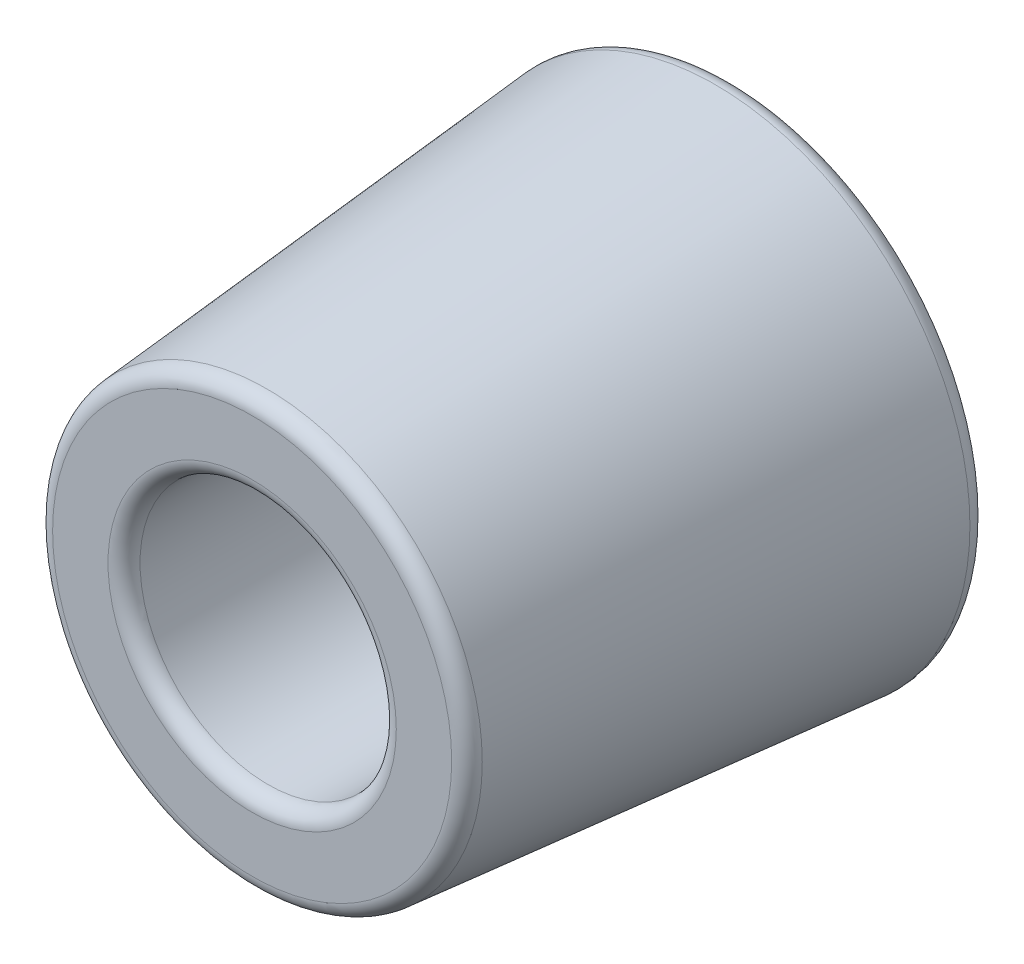
ISO-10303-21;
HEADER;
FILE_DESCRIPTION(('STEP AP214'),'2;1');
FILE_NAME('part.step','',(''),(''),'','','');
FILE_SCHEMA(('AUTOMOTIVE_DESIGN { 1 0 10303 214 1 1 1 1 }'));
ENDSEC;
DATA;
#1=APPLICATION_CONTEXT('core data for automotive mechanical design processes');
#2=APPLICATION_PROTOCOL_DEFINITION('international standard','automotive_design',2000,#1);
#3=PRODUCT_CONTEXT('',#1,'mechanical');
#4=PRODUCT('Part','Part','',(#3));
#5=PRODUCT_RELATED_PRODUCT_CATEGORY('part','',(#4));
#6=PRODUCT_DEFINITION_FORMATION('','',#4);
#7=PRODUCT_DEFINITION_CONTEXT('part definition',#1,'design');
#8=PRODUCT_DEFINITION('design','',#6,#7);
#9=PRODUCT_DEFINITION_SHAPE('','',#8);
#10=(LENGTH_UNIT() NAMED_UNIT(*) SI_UNIT(.MILLI.,.METRE.));
#11=(NAMED_UNIT(*) PLANE_ANGLE_UNIT() SI_UNIT($,.RADIAN.));
#12=(NAMED_UNIT(*) SI_UNIT($,.STERADIAN.) SOLID_ANGLE_UNIT());
#13=UNCERTAINTY_MEASURE_WITH_UNIT(LENGTH_MEASURE(1.E-05),#10,'distance_accuracy_value','');
#14=(GEOMETRIC_REPRESENTATION_CONTEXT(3) GLOBAL_UNCERTAINTY_ASSIGNED_CONTEXT((#13)) GLOBAL_UNIT_ASSIGNED_CONTEXT((#10,
#11,#12)) REPRESENTATION_CONTEXT('',''));
#15=CARTESIAN_POINT('',(0.,0.,0.));
#16=DIRECTION('',(0.,0.,1.));
#17=DIRECTION('',(1.,0.,0.));
#18=AXIS2_PLACEMENT_3D('',#15,#16,#17);
#19=CARTESIAN_POINT('',(0.,0.,-15.));
#20=DIRECTION('',(0.,0.,1.));
#21=DIRECTION('',(1.,0.,0.));
#22=AXIS2_PLACEMENT_3D('',#19,#20,#21);
#23=CYLINDRICAL_SURFACE('',#22,2.5);
#24=CARTESIAN_POINT('',(0.,0.,0.));
#25=DIRECTION('',(0.,0.,1.));
#26=DIRECTION('',(1.,0.,0.));
#27=AXIS2_PLACEMENT_3D('',#24,#25,#26);
#28=CIRCLE('',#27,2.5);
#29=CARTESIAN_POINT('',(2.5,0.,0.));
#30=VERTEX_POINT('',#29);
#31=EDGE_CURVE('E67',#30,#30,#28,.T.);
#32=ORIENTED_EDGE('',*,*,#31,.F.);
#33=EDGE_LOOP('',(#32));
#34=FACE_BOUND('',#33,.T.);
#35=CARTESIAN_POINT('',(0.,0.,5.));
#36=DIRECTION('',(0.,0.,1.));
#37=DIRECTION('',(1.,0.,0.));
#38=AXIS2_PLACEMENT_3D('',#35,#36,#37);
#39=CIRCLE('',#38,2.5);
#40=CARTESIAN_POINT('',(2.5,0.,5.));
#41=VERTEX_POINT('',#40);
#42=EDGE_CURVE('E68',#41,#41,#39,.F.);
#43=ORIENTED_EDGE('',*,*,#42,.F.);
#44=EDGE_LOOP('',(#43));
#45=FACE_BOUND('',#44,.T.);
#46=ADVANCED_FACE('F35',(#34,#45),#23,.F.);
#47=CARTESIAN_POINT('',(0.,0.,0.));
#48=DIRECTION('',(0.,0.,-1.));
#49=DIRECTION('',(1.,0.,0.));
#50=AXIS2_PLACEMENT_3D('',#47,#48,#49);
#51=CONICAL_SURFACE('',#50,8.,0.0872664625997167);
#52=CARTESIAN_POINT('',(0.,0.,14.5435778713738));
#53=DIRECTION('',(0.,0.,-1.));
#54=DIRECTION('',(-1.,0.,0.));
#55=AXIS2_PLACEMENT_3D('',#52,#53,#54);
#56=CIRCLE('',#55,6.7276018091483);
#57=CARTESIAN_POINT('',(-6.7276018091483,0.,14.5435778713738));
#58=VERTEX_POINT('',#57);
#59=EDGE_CURVE('E10',#58,#58,#56,.T.);
#60=ORIENTED_EDGE('',*,*,#59,.T.);
#61=EDGE_LOOP('',(#60));
#62=FACE_BOUND('',#61,.T.);
#63=CARTESIAN_POINT('',(0.,0.,0.543577871373824));
#64=DIRECTION('',(0.,0.,1.));
#65=DIRECTION('',(1.,0.,0.));
#66=AXIS2_PLACEMENT_3D('',#63,#64,#65);
#67=CIRCLE('',#66,7.95244309851124);
#68=CARTESIAN_POINT('',(7.95244309851124,0.,0.543577871373824));
#69=VERTEX_POINT('',#68);
#70=EDGE_CURVE('E54',#69,#69,#67,.T.);
#71=ORIENTED_EDGE('',*,*,#70,.T.);
#72=EDGE_LOOP('',(#71));
#73=FACE_BOUND('',#72,.T.);
#74=ADVANCED_FACE('F99',(#62,#73),#51,.T.);
#75=CARTESIAN_POINT('',(0.,0.,15.));
#76=DIRECTION('',(0.,0.,1.));
#77=DIRECTION('',(1.,0.,0.));
#78=AXIS2_PLACEMENT_3D('',#75,#76,#77);
#79=PLANE('',#78);
#80=CARTESIAN_POINT('',(0.,0.,15.));
#81=DIRECTION('',(0.,0.,1.));
#82=DIRECTION('',(1.,0.,0.));
#83=AXIS2_PLACEMENT_3D('',#80,#81,#82);
#84=CIRCLE('',#83,6.22950446010243);
#85=CARTESIAN_POINT('',(6.22950446010243,0.,15.));
#86=VERTEX_POINT('',#85);
#87=EDGE_CURVE('E43',#86,#86,#84,.T.);
#88=ORIENTED_EDGE('',*,*,#87,.T.);
#89=EDGE_LOOP('',(#88));
#90=FACE_BOUND('',#89,.T.);
#91=CARTESIAN_POINT('',(0.,0.,15.));
#92=DIRECTION('',(0.,0.,1.));
#93=DIRECTION('',(1.,0.,0.));
#94=AXIS2_PLACEMENT_3D('',#91,#92,#93);
#95=CIRCLE('',#94,4.5);
#96=CARTESIAN_POINT('',(4.5,0.,15.));
#97=VERTEX_POINT('',#96);
#98=EDGE_CURVE('E60',#97,#97,#95,.F.);
#99=ORIENTED_EDGE('',*,*,#98,.T.);
#100=EDGE_LOOP('',(#99));
#101=FACE_BOUND('',#100,.T.);
#102=ADVANCED_FACE('F104',(#90,#101),#79,.T.);
#103=CARTESIAN_POINT('',(0.,0.,0.));
#104=DIRECTION('',(0.,0.,1.));
#105=DIRECTION('',(1.,0.,0.));
#106=AXIS2_PLACEMENT_3D('',#103,#104,#105);
#107=PLANE('',#106);
#108=CARTESIAN_POINT('',(0.,0.,0.));
#109=DIRECTION('',(0.,0.,1.));
#110=DIRECTION('',(1.,0.,0.));
#111=AXIS2_PLACEMENT_3D('',#108,#109,#110);
#112=CIRCLE('',#111,7.45434574946536);
#113=CARTESIAN_POINT('',(7.45434574946536,0.,0.));
#114=VERTEX_POINT('',#113);
#115=EDGE_CURVE('E48',#114,#114,#112,.F.);
#116=ORIENTED_EDGE('',*,*,#115,.T.);
#117=EDGE_LOOP('',(#116));
#118=FACE_BOUND('',#117,.T.);
#119=ORIENTED_EDGE('',*,*,#31,.T.);
#120=EDGE_LOOP('',(#119));
#121=FACE_BOUND('',#120,.T.);
#122=ADVANCED_FACE('F95',(#118,#121),#107,.F.);
#123=CARTESIAN_POINT('',(0.,0.,5.));
#124=DIRECTION('',(0.,0.,1.));
#125=DIRECTION('',(1.,0.,0.));
#126=AXIS2_PLACEMENT_3D('',#123,#124,#125);
#127=PLANE('',#126);
#128=CARTESIAN_POINT('',(0.,0.,5.));
#129=DIRECTION('',(0.,0.,1.));
#130=DIRECTION('',(1.,0.,0.));
#131=AXIS2_PLACEMENT_3D('',#128,#129,#130);
#132=CIRCLE('',#131,4.);
#133=CARTESIAN_POINT('',(4.,0.,5.));
#134=VERTEX_POINT('',#133);
#135=EDGE_CURVE('E72',#134,#134,#132,.T.);
#136=ORIENTED_EDGE('',*,*,#135,.T.);
#137=EDGE_LOOP('',(#136));
#138=FACE_BOUND('',#137,.T.);
#139=ORIENTED_EDGE('',*,*,#42,.T.);
#140=EDGE_LOOP('',(#139));
#141=FACE_BOUND('',#140,.T.);
#142=ADVANCED_FACE('F80',(#138,#141),#127,.T.);
#143=CARTESIAN_POINT('',(0.,0.,5.));
#144=DIRECTION('',(0.,0.,1.));
#145=DIRECTION('',(1.,0.,0.));
#146=AXIS2_PLACEMENT_3D('',#143,#144,#145);
#147=CYLINDRICAL_SURFACE('',#146,4.);
#148=CARTESIAN_POINT('',(0.,0.,14.5));
#149=DIRECTION('',(0.,0.,1.));
#150=DIRECTION('',(1.,0.,0.));
#151=AXIS2_PLACEMENT_3D('',#148,#149,#150);
#152=CIRCLE('',#151,4.);
#153=CARTESIAN_POINT('',(4.,0.,14.5));
#154=VERTEX_POINT('',#153);
#155=EDGE_CURVE('E63',#154,#154,#152,.T.);
#156=ORIENTED_EDGE('',*,*,#155,.T.);
#157=EDGE_LOOP('',(#156));
#158=FACE_BOUND('',#157,.T.);
#159=ORIENTED_EDGE('',*,*,#135,.F.);
#160=EDGE_LOOP('',(#159));
#161=FACE_BOUND('',#160,.T.);
#162=ADVANCED_FACE('F83',(#158,#161),#147,.F.);
#163=CARTESIAN_POINT('',(0.,0.,14.5));
#164=DIRECTION('',(0.,0.,1.));
#165=DIRECTION('',(1.,0.,0.));
#166=AXIS2_PLACEMENT_3D('',#163,#164,#165);
#167=TOROIDAL_SURFACE('',#166,4.5,0.5);
#168=ORIENTED_EDGE('',*,*,#98,.F.);
#169=EDGE_LOOP('',(#168));
#170=FACE_BOUND('',#169,.T.);
#171=ORIENTED_EDGE('',*,*,#155,.F.);
#172=EDGE_LOOP('',(#171));
#173=FACE_BOUND('',#172,.T.);
#174=ADVANCED_FACE('F85',(#170,#173),#167,.T.);
#175=CARTESIAN_POINT('',(0.,0.,0.5));
#176=DIRECTION('',(0.,0.,1.));
#177=DIRECTION('',(1.,0.,0.));
#178=AXIS2_PLACEMENT_3D('',#175,#176,#177);
#179=TOROIDAL_SURFACE('',#178,7.45434574946536,0.5);
#180=ORIENTED_EDGE('',*,*,#115,.F.);
#181=EDGE_LOOP('',(#180));
#182=FACE_BOUND('',#181,.T.);
#183=ORIENTED_EDGE('',*,*,#70,.F.);
#184=EDGE_LOOP('',(#183));
#185=FACE_BOUND('',#184,.T.);
#186=ADVANCED_FACE('F92',(#182,#185),#179,.T.);
#187=CARTESIAN_POINT('',(0.,0.,14.5));
#188=DIRECTION('',(0.,0.,1.));
#189=DIRECTION('',(1.,0.,0.));
#190=AXIS2_PLACEMENT_3D('',#187,#188,#189);
#191=TOROIDAL_SURFACE('',#190,6.22950446010243,0.5);
#192=ORIENTED_EDGE('',*,*,#59,.F.);
#193=EDGE_LOOP('',(#192));
#194=FACE_BOUND('',#193,.T.);
#195=ORIENTED_EDGE('',*,*,#87,.F.);
#196=EDGE_LOOP('',(#195));
#197=FACE_BOUND('',#196,.T.);
#198=ADVANCED_FACE('F37',(#194,#197),#191,.T.);
#199=CLOSED_SHELL('',(#46,#74,#102,#122,#142,#162,#174,#186,#198));
#200=MANIFOLD_SOLID_BREP('B2',#199);
#201=ADVANCED_BREP_SHAPE_REPRESENTATION('',(#18,#200),#14);
#202=SHAPE_DEFINITION_REPRESENTATION(#9,#201);
ENDSEC;
END-ISO-10303-21;
